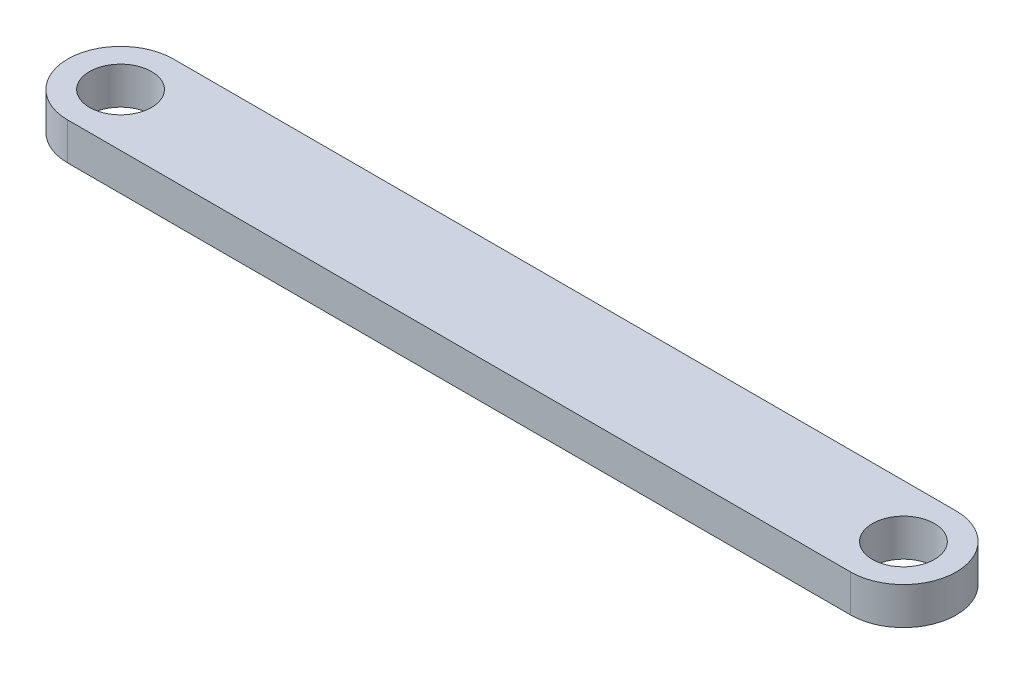
ISO-10303-21;
HEADER;
FILE_DESCRIPTION(('STEP AP214'),'2;1');
FILE_NAME('part.step','',(''),(''),'','','');
FILE_SCHEMA(('AUTOMOTIVE_DESIGN { 1 0 10303 214 1 1 1 1 }'));
ENDSEC;
DATA;
#1=APPLICATION_CONTEXT('core data for automotive mechanical design processes');
#2=APPLICATION_PROTOCOL_DEFINITION('international standard','automotive_design',2000,#1);
#3=PRODUCT_CONTEXT('',#1,'mechanical');
#4=PRODUCT('Part','Part','',(#3));
#5=PRODUCT_RELATED_PRODUCT_CATEGORY('part','',(#4));
#6=PRODUCT_DEFINITION_FORMATION('','',#4);
#7=PRODUCT_DEFINITION_CONTEXT('part definition',#1,'design');
#8=PRODUCT_DEFINITION('design','',#6,#7);
#9=PRODUCT_DEFINITION_SHAPE('','',#8);
#10=(LENGTH_UNIT() NAMED_UNIT(*) SI_UNIT(.MILLI.,.METRE.));
#11=(NAMED_UNIT(*) PLANE_ANGLE_UNIT() SI_UNIT($,.RADIAN.));
#12=(NAMED_UNIT(*) SI_UNIT($,.STERADIAN.) SOLID_ANGLE_UNIT());
#13=UNCERTAINTY_MEASURE_WITH_UNIT(LENGTH_MEASURE(1.E-05),#10,'distance_accuracy_value','');
#14=(GEOMETRIC_REPRESENTATION_CONTEXT(3) GLOBAL_UNCERTAINTY_ASSIGNED_CONTEXT((#13)) GLOBAL_UNIT_ASSIGNED_CONTEXT((#10,
#11,#12)) REPRESENTATION_CONTEXT('',''));
#15=CARTESIAN_POINT('',(0.,0.,0.));
#16=DIRECTION('',(0.,0.,1.));
#17=DIRECTION('',(1.,0.,0.));
#18=AXIS2_PLACEMENT_3D('',#15,#16,#17);
#19=CARTESIAN_POINT('',(0.,3.,0.));
#20=DIRECTION('',(0.,-1.,0.));
#21=DIRECTION('',(0.,0.,-1.));
#22=AXIS2_PLACEMENT_3D('',#19,#20,#21);
#23=CYLINDRICAL_SURFACE('',#22,4.25);
#24=CARTESIAN_POINT('',(0.,0.,0.));
#25=DIRECTION('',(0.,-1.,0.));
#26=DIRECTION('',(0.,0.,-1.));
#27=AXIS2_PLACEMENT_3D('',#24,#25,#26);
#28=CIRCLE('',#27,4.25);
#29=CARTESIAN_POINT('',(0.,0.,4.25));
#30=VERTEX_POINT('',#29);
#31=CARTESIAN_POINT('',(0.,0.,-4.25));
#32=VERTEX_POINT('',#31);
#33=EDGE_CURVE('E98',#30,#32,#28,.T.);
#34=ORIENTED_EDGE('',*,*,#33,.F.);
#35=DIRECTION('',(0.,-1.,0.));
#36=VECTOR('',#35,1.);
#37=CARTESIAN_POINT('',(0.,3.,4.25));
#38=LINE('',#37,#36);
#39=CARTESIAN_POINT('',(0.,3.,4.25));
#40=VERTEX_POINT('',#39);
#41=EDGE_CURVE('E11',#40,#30,#38,.T.);
#42=ORIENTED_EDGE('',*,*,#41,.F.);
#43=CARTESIAN_POINT('',(0.,3.,0.));
#44=DIRECTION('',(0.,-1.,0.));
#45=DIRECTION('',(0.,0.,-1.));
#46=AXIS2_PLACEMENT_3D('',#43,#44,#45);
#47=CIRCLE('',#46,4.25);
#48=CARTESIAN_POINT('',(0.,3.,-4.25));
#49=VERTEX_POINT('',#48);
#50=EDGE_CURVE('E91',#40,#49,#47,.T.);
#51=ORIENTED_EDGE('',*,*,#50,.T.);
#52=DIRECTION('',(0.,-1.,0.));
#53=VECTOR('',#52,1.);
#54=CARTESIAN_POINT('',(0.,3.,-4.25));
#55=LINE('',#54,#53);
#56=EDGE_CURVE('E35',#49,#32,#55,.T.);
#57=ORIENTED_EDGE('',*,*,#56,.T.);
#58=EDGE_LOOP('',(#34,#42,#51,#57));
#59=FACE_BOUND('',#58,.T.);
#60=ADVANCED_FACE('F32',(#59),#23,.T.);
#61=CARTESIAN_POINT('',(0.,3.,4.25));
#62=DIRECTION('',(0.,0.,-1.));
#63=DIRECTION('',(-1.,0.,0.));
#64=AXIS2_PLACEMENT_3D('',#61,#62,#63);
#65=PLANE('',#64);
#66=DIRECTION('',(1.,0.,0.));
#67=VECTOR('',#66,1.);
#68=CARTESIAN_POINT('',(0.,0.,4.25));
#69=LINE('',#68,#67);
#70=CARTESIAN_POINT('',(63.,0.,4.25));
#71=VERTEX_POINT('',#70);
#72=EDGE_CURVE('E93',#30,#71,#69,.T.);
#73=ORIENTED_EDGE('',*,*,#72,.T.);
#74=DIRECTION('',(0.,-1.,0.));
#75=VECTOR('',#74,1.);
#76=CARTESIAN_POINT('',(63.,3.,4.25));
#77=LINE('',#76,#75);
#78=CARTESIAN_POINT('',(63.,3.,4.25));
#79=VERTEX_POINT('',#78);
#80=EDGE_CURVE('E41',#79,#71,#77,.T.);
#81=ORIENTED_EDGE('',*,*,#80,.F.);
#82=DIRECTION('',(1.,0.,0.));
#83=VECTOR('',#82,1.);
#84=CARTESIAN_POINT('',(0.,3.,4.25));
#85=LINE('',#84,#83);
#86=EDGE_CURVE('E88',#40,#79,#85,.T.);
#87=ORIENTED_EDGE('',*,*,#86,.F.);
#88=ORIENTED_EDGE('',*,*,#41,.T.);
#89=EDGE_LOOP('',(#73,#81,#87,#88));
#90=FACE_BOUND('',#89,.T.);
#91=ADVANCED_FACE('F106',(#90),#65,.F.);
#92=CARTESIAN_POINT('',(63.,3.,0.));
#93=DIRECTION('',(0.,-1.,0.));
#94=DIRECTION('',(0.,0.,-1.));
#95=AXIS2_PLACEMENT_3D('',#92,#93,#94);
#96=CYLINDRICAL_SURFACE('',#95,4.25);
#97=CARTESIAN_POINT('',(63.,0.,0.));
#98=DIRECTION('',(0.,-1.,0.));
#99=DIRECTION('',(0.,0.,-1.));
#100=AXIS2_PLACEMENT_3D('',#97,#98,#99);
#101=CIRCLE('',#100,4.25);
#102=CARTESIAN_POINT('',(63.,0.,-4.25));
#103=VERTEX_POINT('',#102);
#104=EDGE_CURVE('E82',#103,#71,#101,.T.);
#105=ORIENTED_EDGE('',*,*,#104,.F.);
#106=DIRECTION('',(0.,-1.,0.));
#107=VECTOR('',#106,1.);
#108=CARTESIAN_POINT('',(63.,3.,-4.25));
#109=LINE('',#108,#107);
#110=CARTESIAN_POINT('',(63.,3.,-4.25));
#111=VERTEX_POINT('',#110);
#112=EDGE_CURVE('E77',#111,#103,#109,.T.);
#113=ORIENTED_EDGE('',*,*,#112,.F.);
#114=CARTESIAN_POINT('',(63.,3.,0.));
#115=DIRECTION('',(0.,-1.,0.));
#116=DIRECTION('',(0.,0.,-1.));
#117=AXIS2_PLACEMENT_3D('',#114,#115,#116);
#118=CIRCLE('',#117,4.25);
#119=EDGE_CURVE('E80',#111,#79,#118,.T.);
#120=ORIENTED_EDGE('',*,*,#119,.T.);
#121=ORIENTED_EDGE('',*,*,#80,.T.);
#122=EDGE_LOOP('',(#105,#113,#120,#121));
#123=FACE_BOUND('',#122,.T.);
#124=ADVANCED_FACE('F79',(#123),#96,.T.);
#125=CARTESIAN_POINT('',(0.,3.,-4.25));
#126=DIRECTION('',(0.,0.,-1.));
#127=DIRECTION('',(-1.,0.,0.));
#128=AXIS2_PLACEMENT_3D('',#125,#126,#127);
#129=PLANE('',#128);
#130=DIRECTION('',(1.,0.,0.));
#131=VECTOR('',#130,1.);
#132=CARTESIAN_POINT('',(0.,0.,-4.25));
#133=LINE('',#132,#131);
#134=EDGE_CURVE('E101',#32,#103,#133,.T.);
#135=ORIENTED_EDGE('',*,*,#134,.F.);
#136=ORIENTED_EDGE('',*,*,#56,.F.);
#137=DIRECTION('',(1.,0.,0.));
#138=VECTOR('',#137,1.);
#139=CARTESIAN_POINT('',(0.,3.,-4.25));
#140=LINE('',#139,#138);
#141=EDGE_CURVE('E87',#49,#111,#140,.T.);
#142=ORIENTED_EDGE('',*,*,#141,.T.);
#143=ORIENTED_EDGE('',*,*,#112,.T.);
#144=EDGE_LOOP('',(#135,#136,#142,#143));
#145=FACE_BOUND('',#144,.T.);
#146=ADVANCED_FACE('F90',(#145),#129,.T.);
#147=CARTESIAN_POINT('',(0.,3.,0.));
#148=DIRECTION('',(0.,-1.,0.));
#149=DIRECTION('',(0.,0.,-1.));
#150=AXIS2_PLACEMENT_3D('',#147,#148,#149);
#151=PLANE('',#150);
#152=CARTESIAN_POINT('',(63.,3.,0.));
#153=DIRECTION('',(0.,1.,0.));
#154=DIRECTION('',(0.,0.,1.));
#155=AXIS2_PLACEMENT_3D('',#152,#153,#154);
#156=CIRCLE('',#155,2.5);
#157=CARTESIAN_POINT('',(63.,3.,2.5));
#158=VERTEX_POINT('',#157);
#159=EDGE_CURVE('E146',#158,#158,#156,.T.);
#160=ORIENTED_EDGE('',*,*,#159,.F.);
#161=EDGE_LOOP('',(#160));
#162=FACE_BOUND('',#161,.T.);
#163=CARTESIAN_POINT('',(0.,3.,0.));
#164=DIRECTION('',(0.,1.,0.));
#165=DIRECTION('',(0.,0.,1.));
#166=AXIS2_PLACEMENT_3D('',#163,#164,#165);
#167=CIRCLE('',#166,2.5);
#168=CARTESIAN_POINT('',(0.,3.,2.5));
#169=VERTEX_POINT('',#168);
#170=EDGE_CURVE('E148',#169,#169,#167,.T.);
#171=ORIENTED_EDGE('',*,*,#170,.F.);
#172=EDGE_LOOP('',(#171));
#173=FACE_BOUND('',#172,.T.);
#174=ORIENTED_EDGE('',*,*,#50,.F.);
#175=ORIENTED_EDGE('',*,*,#86,.T.);
#176=ORIENTED_EDGE('',*,*,#119,.F.);
#177=ORIENTED_EDGE('',*,*,#141,.F.);
#178=EDGE_LOOP('',(#174,#175,#176,#177));
#179=FACE_BOUND('',#178,.T.);
#180=ADVANCED_FACE('F86',(#162,#173,#179),#151,.F.);
#181=CARTESIAN_POINT('',(0.,0.,0.));
#182=DIRECTION('',(0.,-1.,0.));
#183=DIRECTION('',(0.,0.,-1.));
#184=AXIS2_PLACEMENT_3D('',#181,#182,#183);
#185=PLANE('',#184);
#186=CARTESIAN_POINT('',(63.,0.,0.));
#187=DIRECTION('',(0.,1.,0.));
#188=DIRECTION('',(0.,0.,1.));
#189=AXIS2_PLACEMENT_3D('',#186,#187,#188);
#190=CIRCLE('',#189,2.5);
#191=CARTESIAN_POINT('',(63.,0.,2.5));
#192=VERTEX_POINT('',#191);
#193=EDGE_CURVE('E144',#192,#192,#190,.T.);
#194=ORIENTED_EDGE('',*,*,#193,.T.);
#195=EDGE_LOOP('',(#194));
#196=FACE_BOUND('',#195,.T.);
#197=CARTESIAN_POINT('',(0.,0.,0.));
#198=DIRECTION('',(0.,1.,0.));
#199=DIRECTION('',(0.,0.,1.));
#200=AXIS2_PLACEMENT_3D('',#197,#198,#199);
#201=CIRCLE('',#200,2.5);
#202=CARTESIAN_POINT('',(0.,0.,2.5));
#203=VERTEX_POINT('',#202);
#204=EDGE_CURVE('E102',#203,#203,#201,.T.);
#205=ORIENTED_EDGE('',*,*,#204,.T.);
#206=EDGE_LOOP('',(#205));
#207=FACE_BOUND('',#206,.T.);
#208=ORIENTED_EDGE('',*,*,#33,.T.);
#209=ORIENTED_EDGE('',*,*,#134,.T.);
#210=ORIENTED_EDGE('',*,*,#104,.T.);
#211=ORIENTED_EDGE('',*,*,#72,.F.);
#212=EDGE_LOOP('',(#208,#209,#210,#211));
#213=FACE_BOUND('',#212,.T.);
#214=ADVANCED_FACE('F108',(#196,#207,#213),#185,.T.);
#215=CARTESIAN_POINT('',(0.,0.,0.));
#216=DIRECTION('',(0.,1.,0.));
#217=DIRECTION('',(0.,0.,1.));
#218=AXIS2_PLACEMENT_3D('',#215,#216,#217);
#219=CYLINDRICAL_SURFACE('',#218,2.5);
#220=ORIENTED_EDGE('',*,*,#204,.F.);
#221=EDGE_LOOP('',(#220));
#222=FACE_BOUND('',#221,.T.);
#223=ORIENTED_EDGE('',*,*,#170,.T.);
#224=EDGE_LOOP('',(#223));
#225=FACE_BOUND('',#224,.T.);
#226=ADVANCED_FACE('F128',(#222,#225),#219,.F.);
#227=CARTESIAN_POINT('',(63.,0.,0.));
#228=DIRECTION('',(0.,1.,0.));
#229=DIRECTION('',(0.,0.,1.));
#230=AXIS2_PLACEMENT_3D('',#227,#228,#229);
#231=CYLINDRICAL_SURFACE('',#230,2.5);
#232=ORIENTED_EDGE('',*,*,#193,.F.);
#233=EDGE_LOOP('',(#232));
#234=FACE_BOUND('',#233,.T.);
#235=ORIENTED_EDGE('',*,*,#159,.T.);
#236=EDGE_LOOP('',(#235));
#237=FACE_BOUND('',#236,.T.);
#238=ADVANCED_FACE('F135',(#234,#237),#231,.F.);
#239=CLOSED_SHELL('',(#60,#91,#124,#146,#180,#214,#226,#238));
#240=MANIFOLD_SOLID_BREP('B2',#239);
#241=ADVANCED_BREP_SHAPE_REPRESENTATION('',(#18,#240),#14);
#242=SHAPE_DEFINITION_REPRESENTATION(#9,#241);
ENDSEC;
END-ISO-10303-21;
